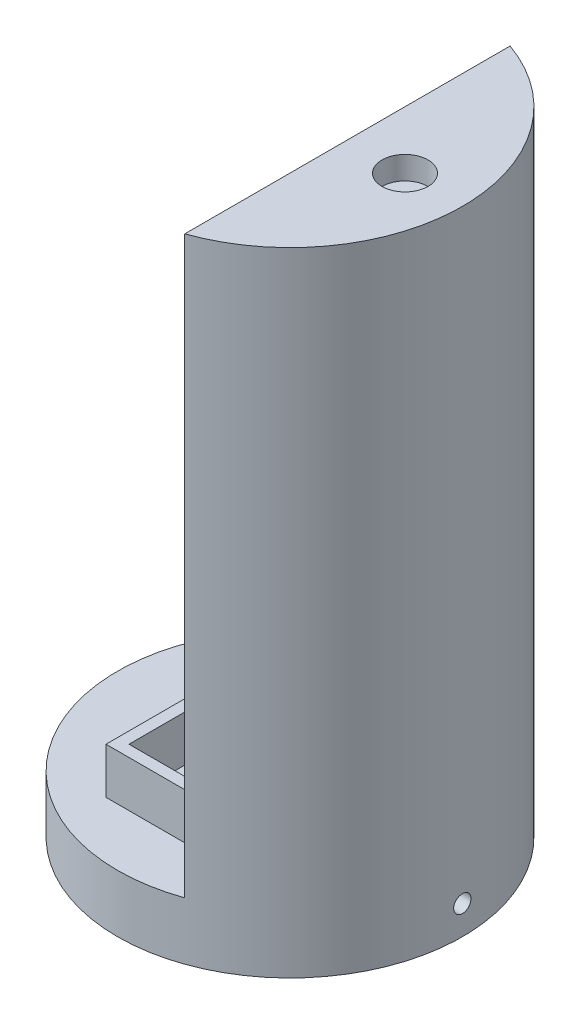
ISO-10303-21;
HEADER;
FILE_DESCRIPTION(('STEP AP214'),'2;1');
FILE_NAME('part.step','',(''),(''),'','','');
FILE_SCHEMA(('AUTOMOTIVE_DESIGN { 1 0 10303 214 1 1 1 1 }'));
ENDSEC;
DATA;
#1=APPLICATION_CONTEXT('core data for automotive mechanical design processes');
#2=APPLICATION_PROTOCOL_DEFINITION('international standard','automotive_design',2000,#1);
#3=PRODUCT_CONTEXT('',#1,'mechanical');
#4=PRODUCT('Part','Part','',(#3));
#5=PRODUCT_RELATED_PRODUCT_CATEGORY('part','',(#4));
#6=PRODUCT_DEFINITION_FORMATION('','',#4);
#7=PRODUCT_DEFINITION_CONTEXT('part definition',#1,'design');
#8=PRODUCT_DEFINITION('design','',#6,#7);
#9=PRODUCT_DEFINITION_SHAPE('','',#8);
#10=(LENGTH_UNIT() NAMED_UNIT(*) SI_UNIT(.MILLI.,.METRE.));
#11=(NAMED_UNIT(*) PLANE_ANGLE_UNIT() SI_UNIT($,.RADIAN.));
#12=(NAMED_UNIT(*) SI_UNIT($,.STERADIAN.) SOLID_ANGLE_UNIT());
#13=UNCERTAINTY_MEASURE_WITH_UNIT(LENGTH_MEASURE(1.E-05),#10,'distance_accuracy_value','');
#14=(GEOMETRIC_REPRESENTATION_CONTEXT(3) GLOBAL_UNCERTAINTY_ASSIGNED_CONTEXT((#13)) GLOBAL_UNIT_ASSIGNED_CONTEXT((#10,
#11,#12)) REPRESENTATION_CONTEXT('',''));
#15=CARTESIAN_POINT('',(0.,0.,0.));
#16=DIRECTION('',(0.,0.,1.));
#17=DIRECTION('',(1.,0.,0.));
#18=AXIS2_PLACEMENT_3D('',#15,#16,#17);
#19=CARTESIAN_POINT('',(0.,12.7,0.));
#20=DIRECTION('',(0.,-1.,0.));
#21=DIRECTION('',(0.,0.,-1.));
#22=AXIS2_PLACEMENT_3D('',#19,#20,#21);
#23=CYLINDRICAL_SURFACE('',#22,38.1);
#24=CARTESIAN_POINT('',(0.,12.7,0.));
#25=DIRECTION('',(0.,1.,0.));
#26=DIRECTION('',(0.,0.,1.));
#27=AXIS2_PLACEMENT_3D('',#24,#25,#26);
#28=CIRCLE('',#27,38.1);
#29=CARTESIAN_POINT('',(12.6806368116867,12.7,-35.9278645350666));
#30=VERTEX_POINT('',#29);
#31=CARTESIAN_POINT('',(12.6806368116867,12.7,35.9278645350666));
#32=VERTEX_POINT('',#31);
#33=EDGE_CURVE('E46',#30,#32,#28,.T.);
#34=ORIENTED_EDGE('',*,*,#33,.F.);
#35=DIRECTION('',(0.,-1.,0.));
#36=VECTOR('',#35,1.);
#37=CARTESIAN_POINT('',(12.6806368116867,139.7,-35.9278645350666));
#38=LINE('',#37,#36);
#39=CARTESIAN_POINT('',(12.6806368116867,139.7,-35.9278645350666));
#40=VERTEX_POINT('',#39);
#41=EDGE_CURVE('E125',#40,#30,#38,.T.);
#42=ORIENTED_EDGE('',*,*,#41,.F.);
#43=CARTESIAN_POINT('',(0.,139.7,0.));
#44=DIRECTION('',(0.,1.,0.));
#45=DIRECTION('',(0.,0.,1.));
#46=AXIS2_PLACEMENT_3D('',#43,#44,#45);
#47=CIRCLE('',#46,38.1);
#48=CARTESIAN_POINT('',(12.6806368116867,139.7,35.9278645350666));
#49=VERTEX_POINT('',#48);
#50=EDGE_CURVE('E118',#49,#40,#47,.T.);
#51=ORIENTED_EDGE('',*,*,#50,.F.);
#52=DIRECTION('',(0.,-1.,0.));
#53=VECTOR('',#52,1.);
#54=CARTESIAN_POINT('',(12.6806368116867,139.7,35.9278645350666));
#55=LINE('',#54,#53);
#56=EDGE_CURVE('E123',#49,#32,#55,.T.);
#57=ORIENTED_EDGE('',*,*,#56,.T.);
#58=EDGE_LOOP('',(#34,#42,#51,#57));
#59=FACE_BOUND('',#58,.T.);
#60=CARTESIAN_POINT('',(0.,0.,0.));
#61=DIRECTION('',(0.,1.,0.));
#62=DIRECTION('',(0.,0.,1.));
#63=AXIS2_PLACEMENT_3D('',#60,#61,#62);
#64=CIRCLE('',#63,38.1);
#65=CARTESIAN_POINT('',(0.,0.,38.1));
#66=VERTEX_POINT('',#65);
#67=EDGE_CURVE('E189',#66,#66,#64,.T.);
#68=ORIENTED_EDGE('',*,*,#67,.T.);
#69=EDGE_LOOP('',(#68));
#70=FACE_BOUND('',#69,.T.);
#71=CARTESIAN_POINT('',(-38.0523451971097,6.35,1.90499999999999));
#72=CARTESIAN_POINT('',(-38.0523458372646,6.45693290588869,1.90499528064471));
#73=CARTESIAN_POINT('',(-38.0528007885922,6.56394164568236,1.8959661010928));
#74=CARTESIAN_POINT('',(-38.0545717554989,6.77500712366543,1.86007496828752));
#75=CARTESIAN_POINT('',(-38.0558887856008,6.87906023284576,1.83319200356398));
#76=CARTESIAN_POINT('',(-38.0592343528177,7.08112641111174,1.76236492554556));
#77=CARTESIAN_POINT('',(-38.0612625271739,7.179142529787,1.71842950958168));
#78=CARTESIAN_POINT('',(-38.0658013905468,7.36638198231956,1.61475804513454));
#79=CARTESIAN_POINT('',(-38.0683119656292,7.45560738487128,1.55502572634059));
#80=CARTESIAN_POINT('',(-38.0735356425949,7.62284951446359,1.42138869135167));
#81=CARTESIAN_POINT('',(-38.0762489219195,7.7008562421088,1.34747146719899));
#82=CARTESIAN_POINT('',(-38.0815705997685,7.84336145141772,1.18758784411255));
#83=CARTESIAN_POINT('',(-38.0841789940082,7.90785938169321,1.10162095358684));
#84=CARTESIAN_POINT('',(-38.0889983266454,8.02154352551538,0.920026113944158));
#85=CARTESIAN_POINT('',(-38.0912090632333,8.07072197369968,0.824393297644863));
#86=CARTESIAN_POINT('',(-38.0949821658515,8.15232131191011,0.626215542712273));
#87=CARTESIAN_POINT('',(-38.0965445367887,8.18474232875511,0.523670656395599));
#88=CARTESIAN_POINT('',(-38.0988436608447,8.23188014044012,0.314671415599897));
#89=CARTESIAN_POINT('',(-38.0995811100001,8.24661186158189,0.208220435385266));
#90=CARTESIAN_POINT('',(-38.1001496214684,8.25799896585046,-0.00564587679819081));
#91=CARTESIAN_POINT('',(-38.0999806909141,8.25465449122724,-0.113061201171503));
#92=CARTESIAN_POINT('',(-38.0987560659568,8.22999652953438,-0.325706003577355));
#93=CARTESIAN_POINT('',(-38.0977011644333,8.20869910898177,-0.430937349856069));
#94=CARTESIAN_POINT('',(-38.0948243327178,8.14876471621186,-0.636329424385995));
#95=CARTESIAN_POINT('',(-38.0930023993098,8.11012767129669,-0.736490131376157));
#96=CARTESIAN_POINT('',(-38.0887953674449,8.01659247563749,-0.928949461337843));
#97=CARTESIAN_POINT('',(-38.0864100155674,7.96168700466695,-1.0212445209172));
#98=CARTESIAN_POINT('',(-38.0813447741745,7.83717886923093,-1.19531368846818));
#99=CARTESIAN_POINT('',(-38.0786648825792,7.76757610097564,-1.27708772213555));
#100=CARTESIAN_POINT('',(-38.0733088954562,7.61555830994845,-1.42788727708222));
#101=CARTESIAN_POINT('',(-38.0706328072934,7.53312934783952,-1.49689874745765));
#102=CARTESIAN_POINT('',(-38.0655890698724,7.35784799517476,-1.62010594974739));
#103=CARTESIAN_POINT('',(-38.0632214206961,7.26499560184932,-1.67430167772502));
#104=CARTESIAN_POINT('',(-38.0590617842516,7.07149464668819,-1.76633774924874));
#105=CARTESIAN_POINT('',(-38.0572698155799,6.97084583313193,-1.80417756445684));
#106=CARTESIAN_POINT('',(-38.0544643313005,6.76461291962913,-1.86241829155643));
#107=CARTESIAN_POINT('',(-38.0534508098381,6.65902885680732,-1.88281933460648));
#108=CARTESIAN_POINT('',(-38.0523175970383,6.44604498888611,-1.90558602819));
#109=CARTESIAN_POINT('',(-38.0521969391894,6.33864727334563,-1.90797118071586));
#110=CARTESIAN_POINT('',(-38.0528605368865,6.12497713893601,-1.89468928026819));
#111=CARTESIAN_POINT('',(-38.0536447894401,6.01870471634673,-1.87902228699278));
#112=CARTESIAN_POINT('',(-38.0560289329864,5.8103566346034,-1.83009699828166));
#113=CARTESIAN_POINT('',(-38.0576284100868,5.70827887419646,-1.79684762915573));
#114=CARTESIAN_POINT('',(-38.0614623752182,5.51115300279102,-1.71371045085396));
#115=CARTESIAN_POINT('',(-38.063696866924,5.41610493247657,-1.66382254539244));
#116=CARTESIAN_POINT('',(-38.0685513659328,5.23564678741141,-1.54877437789073));
#117=CARTESIAN_POINT('',(-38.0711717031923,5.15024507332023,-1.48360101590896));
#118=CARTESIAN_POINT('',(-38.0765013940179,4.99158798322229,-1.33985110683073));
#119=CARTESIAN_POINT('',(-38.0792107481531,4.91833268487622,-1.26127447404411));
#120=CARTESIAN_POINT('',(-38.0844159277627,4.78598234245765,-1.09286476425131));
#121=CARTESIAN_POINT('',(-38.0869115620207,4.72689989555022,-1.00302178063883));
#122=CARTESIAN_POINT('',(-38.0914053077819,4.62465850990913,-0.814679759205184));
#123=CARTESIAN_POINT('',(-38.0934034214507,4.58149950187105,-0.716180759060381));
#124=CARTESIAN_POINT('',(-38.096676024278,4.51235214583107,-0.513369591195939));
#125=CARTESIAN_POINT('',(-38.0979508530247,4.48635573890788,-0.40906017681841));
#126=CARTESIAN_POINT('',(-38.0996345639705,4.45224513580034,-0.197550588216465));
#127=CARTESIAN_POINT('',(-38.1000434510553,4.44413083872208,-0.0903504303055734));
#128=CARTESIAN_POINT('',(-38.0999492193628,4.44601575561356,0.123772590073404));
#129=CARTESIAN_POINT('',(-38.0994470954988,4.45599520942572,0.230695627491607));
#130=CARTESIAN_POINT('',(-38.0975893281055,4.49374350106739,0.441346231640851));
#131=CARTESIAN_POINT('',(-38.0962336829685,4.52151237240553,0.545073792352419));
#132=CARTESIAN_POINT('',(-38.0928213916629,4.59404720193706,0.746393139053858));
#133=CARTESIAN_POINT('',(-38.0907647403447,4.63881328499392,0.843984879963148));
#134=CARTESIAN_POINT('',(-38.0861817342955,4.74406835792604,1.03026851942982));
#135=CARTESIAN_POINT('',(-38.0836553939837,4.80455686515247,1.1189606910714));
#136=CARTESIAN_POINT('',(-38.0784142133899,4.93961045052615,1.28502623785078));
#137=CARTESIAN_POINT('',(-38.0756991903811,5.01418929779826,1.36238840889243));
#138=CARTESIAN_POINT('',(-38.0703878795251,5.17529759745909,1.50351876872455));
#139=CARTESIAN_POINT('',(-38.0677916210558,5.26182998564674,1.56728360818365));
#140=CARTESIAN_POINT('',(-38.063008920605,5.4444571185154,1.67943918705234));
#141=CARTESIAN_POINT('',(-38.0608228743648,5.54056096160387,1.72781511137466));
#142=CARTESIAN_POINT('',(-38.0571134110098,5.73946568245053,1.80768707555724));
#143=CARTESIAN_POINT('',(-38.0555892116128,5.842258487834,1.83920305362944));
#144=CARTESIAN_POINT('',(-38.053778892819,6.01307495844452,1.87619376168078));
#145=CARTESIAN_POINT('',(-38.0532436280332,6.07999220967407,1.88698230952192));
#146=CARTESIAN_POINT('',(-38.0525265776354,6.21459617054654,1.90138691991542));
#147=CARTESIAN_POINT('',(-38.0523447917205,6.28228287953009,1.90500298861371));
#148=CARTESIAN_POINT('',(-38.0523451971097,6.35,1.90499999999999));
#149=B_SPLINE_CURVE_WITH_KNOTS('',3,(#71,#72,#73,#74,#75,#76,#77,#78,#79,#80,#81,#82,#83,#84,
#85,#86,#87,#88,#89,#90,#91,#92,#93,#94,#95,#96,#97,#98,#99,#100,#101,#102,#103,#104,#105,#106,
#107,#108,#109,#110,#111,#112,#113,#114,#115,#116,#117,#118,#119,#120,#121,#122,#123,#124,#125,
#126,#127,#128,#129,#130,#131,#132,#133,#134,#135,#136,#137,#138,#139,#140,#141,#142,#143,#144,
#145,#146,#147,#148),.UNSPECIFIED.,.T.,.F.,(4,2,2,2,2,2,2,2,2,2,2,2,2,2,2,2,2,2,2,2,2,2,2,2,2,2,
2,2,2,2,2,2,2,2,2,2,2,2,4),(0.,0.320551524060626,0.641480963626901,0.96224693289059,
1.28293723599337,1.60391162746204,1.92489911758192,2.24604905074975,2.56719655344554,
2.8880728796769,3.20894668078709,3.52953362880772,3.8501219209292,4.17085468627854,
4.49158971666373,4.81267578403358,5.13376193671906,5.45485846053676,5.77595256933769,
6.0966990476117,6.417444465186,6.73802720121333,7.05861179245548,7.37947214158489,
7.70033454212425,8.0214810847243,8.34262622956469,8.66362046909027,8.98461289750674,
9.30525498171338,9.62589766989188,9.94654271359421,10.2671779152597,10.588128078616,
10.9091572081926,11.2304944674288,11.5514508753209,11.7544458710267,11.9574406927911),.UNSPECIFIED.);
#150=CARTESIAN_POINT('',(-38.0523451971097,6.35,1.90499999999999));
#151=VERTEX_POINT('',#150);
#152=EDGE_CURVE('E192',#151,#151,#149,.T.);
#153=ORIENTED_EDGE('',*,*,#152,.F.);
#154=EDGE_LOOP('',(#153));
#155=FACE_BOUND('',#154,.T.);
#156=CARTESIAN_POINT('',(38.0523451971097,6.35,1.90499999999999));
#157=CARTESIAN_POINT('',(38.0523458372646,6.24306709411131,1.90499528064471));
#158=CARTESIAN_POINT('',(38.0528007885922,6.13605835431764,1.8959661010928));
#159=CARTESIAN_POINT('',(38.0545717554989,5.92499287633457,1.86007496828752));
#160=CARTESIAN_POINT('',(38.0558887856008,5.82093976715424,1.83319200356398));
#161=CARTESIAN_POINT('',(38.0592343528177,5.61887358888826,1.76236492554556));
#162=CARTESIAN_POINT('',(38.0612625271739,5.520857470213,1.71842950958168));
#163=CARTESIAN_POINT('',(38.0658013905468,5.33361801768044,1.61475804513454));
#164=CARTESIAN_POINT('',(38.0683119656292,5.24439261512871,1.55502572634059));
#165=CARTESIAN_POINT('',(38.0735356425949,5.07715048553641,1.42138869135167));
#166=CARTESIAN_POINT('',(38.0762489219195,4.9991437578912,1.34747146719899));
#167=CARTESIAN_POINT('',(38.0815705997685,4.85663854858228,1.18758784411255));
#168=CARTESIAN_POINT('',(38.0841789940082,4.79214061830679,1.10162095358684));
#169=CARTESIAN_POINT('',(38.0889983266454,4.67845647448462,0.920026113944159));
#170=CARTESIAN_POINT('',(38.0912090632333,4.62927802630032,0.824393297644863));
#171=CARTESIAN_POINT('',(38.0949821658515,4.54767868808989,0.626215542712273));
#172=CARTESIAN_POINT('',(38.0965445367887,4.51525767124489,0.523670656395599));
#173=CARTESIAN_POINT('',(38.0988436608447,4.46811985955988,0.314671415599897));
#174=CARTESIAN_POINT('',(38.0995811100001,4.45338813841811,0.208220435385265));
#175=CARTESIAN_POINT('',(38.1001496214684,4.44200103414954,-0.00564587679819151));
#176=CARTESIAN_POINT('',(38.0999806909141,4.44534550877276,-0.113061201171503));
#177=CARTESIAN_POINT('',(38.0987560659568,4.47000347046562,-0.325706003577355));
#178=CARTESIAN_POINT('',(38.0977011644333,4.49130089101823,-0.430937349856069));
#179=CARTESIAN_POINT('',(38.0948243327178,4.55123528378814,-0.636329424385995));
#180=CARTESIAN_POINT('',(38.0930023993098,4.58987232870331,-0.736490131376157));
#181=CARTESIAN_POINT('',(38.0887953674449,4.68340752436251,-0.928949461337844));
#182=CARTESIAN_POINT('',(38.0864100155674,4.73831299533304,-1.0212445209172));
#183=CARTESIAN_POINT('',(38.0813447741745,4.86282113076907,-1.19531368846818));
#184=CARTESIAN_POINT('',(38.0786648825792,4.93242389902436,-1.27708772213556));
#185=CARTESIAN_POINT('',(38.0733088954562,5.08444169005155,-1.42788727708222));
#186=CARTESIAN_POINT('',(38.0706328072934,5.16687065216048,-1.49689874745765));
#187=CARTESIAN_POINT('',(38.0655890698724,5.34215200482524,-1.62010594974739));
#188=CARTESIAN_POINT('',(38.0632214206961,5.43500439815068,-1.67430167772502));
#189=CARTESIAN_POINT('',(38.0590617842516,5.62850535331181,-1.76633774924874));
#190=CARTESIAN_POINT('',(38.0572698155799,5.72915416686807,-1.80417756445684));
#191=CARTESIAN_POINT('',(38.0544643313005,5.93538708037087,-1.86241829155643));
#192=CARTESIAN_POINT('',(38.0534508098381,6.04097114319267,-1.88281933460648));
#193=CARTESIAN_POINT('',(38.0523175970383,6.25395501111389,-1.90558602819));
#194=CARTESIAN_POINT('',(38.0521969391894,6.36135272665437,-1.90797118071586));
#195=CARTESIAN_POINT('',(38.0528605368865,6.57502286106399,-1.89468928026819));
#196=CARTESIAN_POINT('',(38.0536447894401,6.68129528365327,-1.87902228699278));
#197=CARTESIAN_POINT('',(38.0560289329864,6.8896433653966,-1.83009699828166));
#198=CARTESIAN_POINT('',(38.0576284100868,6.99172112580354,-1.79684762915573));
#199=CARTESIAN_POINT('',(38.0614623752182,7.18884699720899,-1.71371045085396));
#200=CARTESIAN_POINT('',(38.063696866924,7.28389506752343,-1.66382254539244));
#201=CARTESIAN_POINT('',(38.0685513659328,7.46435321258859,-1.54877437789073));
#202=CARTESIAN_POINT('',(38.0711717031923,7.54975492667977,-1.48360101590896));
#203=CARTESIAN_POINT('',(38.0765013940179,7.70841201677771,-1.33985110683073));
#204=CARTESIAN_POINT('',(38.0792107481531,7.78166731512378,-1.26127447404411));
#205=CARTESIAN_POINT('',(38.0844159277627,7.91401765754235,-1.09286476425131));
#206=CARTESIAN_POINT('',(38.0869115620207,7.97310010444978,-1.00302178063882));
#207=CARTESIAN_POINT('',(38.0914053077819,8.07534149009087,-0.814679759205184));
#208=CARTESIAN_POINT('',(38.0934034214507,8.11850049812895,-0.716180759060381));
#209=CARTESIAN_POINT('',(38.096676024278,8.18764785416893,-0.513369591195939));
#210=CARTESIAN_POINT('',(38.0979508530247,8.21364426109212,-0.409060176818409));
#211=CARTESIAN_POINT('',(38.0996345639705,8.24775486419966,-0.197550588216464));
#212=CARTESIAN_POINT('',(38.1000434510553,8.25586916127792,-0.0903504303055732));
#213=CARTESIAN_POINT('',(38.0999492193628,8.25398424438644,0.123772590073404));
#214=CARTESIAN_POINT('',(38.0994470954988,8.24400479057428,0.230695627491607));
#215=CARTESIAN_POINT('',(38.0975893281055,8.20625649893261,0.441346231640851));
#216=CARTESIAN_POINT('',(38.0962336829685,8.17848762759447,0.545073792352419));
#217=CARTESIAN_POINT('',(38.0928213916629,8.10595279806294,0.746393139053858));
#218=CARTESIAN_POINT('',(38.0907647403447,8.06118671500608,0.843984879963148));
#219=CARTESIAN_POINT('',(38.0861817342955,7.95593164207396,1.03026851942982));
#220=CARTESIAN_POINT('',(38.0836553939837,7.89544313484753,1.1189606910714));
#221=CARTESIAN_POINT('',(38.0784142133899,7.76038954947385,1.28502623785078));
#222=CARTESIAN_POINT('',(38.0756991903811,7.68581070220174,1.36238840889243));
#223=CARTESIAN_POINT('',(38.0703878795251,7.52470240254091,1.50351876872455));
#224=CARTESIAN_POINT('',(38.0677916210558,7.43817001435326,1.56728360818365));
#225=CARTESIAN_POINT('',(38.063008920605,7.2555428814846,1.67943918705234));
#226=CARTESIAN_POINT('',(38.0608228743648,7.15943903839613,1.72781511137466));
#227=CARTESIAN_POINT('',(38.0571134110098,6.96053431754947,1.80768707555724));
#228=CARTESIAN_POINT('',(38.0555892116128,6.857741512166,1.83920305362944));
#229=CARTESIAN_POINT('',(38.053778892819,6.68692504155548,1.87619376168078));
#230=CARTESIAN_POINT('',(38.0532436280332,6.62000779032593,1.88698230952192));
#231=CARTESIAN_POINT('',(38.0525265776354,6.48540382945346,1.90138691991542));
#232=CARTESIAN_POINT('',(38.0523447917205,6.41771712046991,1.90500298861371));
#233=CARTESIAN_POINT('',(38.0523451971097,6.35,1.90499999999999));
#234=B_SPLINE_CURVE_WITH_KNOTS('',3,(#156,#157,#158,#159,#160,#161,#162,#163,#164,#165,#166,
#167,#168,#169,#170,#171,#172,#173,#174,#175,#176,#177,#178,#179,#180,#181,#182,#183,#184,#185,
#186,#187,#188,#189,#190,#191,#192,#193,#194,#195,#196,#197,#198,#199,#200,#201,#202,#203,#204,
#205,#206,#207,#208,#209,#210,#211,#212,#213,#214,#215,#216,#217,#218,#219,#220,#221,#222,#223,
#224,#225,#226,#227,#228,#229,#230,#231,#232,#233),.UNSPECIFIED.,.T.,.F.,(4,2,2,2,2,2,2,2,2,2,2,
2,2,2,2,2,2,2,2,2,2,2,2,2,2,2,2,2,2,2,2,2,2,2,2,2,2,2,4),(0.,0.320551524060626,
0.641480963626901,0.96224693289059,1.28293723599337,1.60391162746204,1.92489911758192,
2.24604905074975,2.56719655344554,2.8880728796769,3.20894668078709,3.52953362880772,
3.8501219209292,4.17085468627854,4.49158971666373,4.81267578403358,5.13376193671906,
5.45485846053676,5.77595256933769,6.0966990476117,6.417444465186,6.73802720121333,
7.05861179245548,7.37947214158489,7.70033454212426,8.02148108472431,8.34262622956469,
8.66362046909027,8.98461289750674,9.30525498171338,9.62589766989188,9.94654271359421,
10.2671779152597,10.588128078616,10.9091572081926,11.2304944674288,11.5514508753209,
11.7544458710267,11.9574406927911),.UNSPECIFIED.);
#235=CARTESIAN_POINT('',(38.0523451971097,6.35,1.90499999999999));
#236=VERTEX_POINT('',#235);
#237=EDGE_CURVE('E37',#236,#236,#234,.T.);
#238=ORIENTED_EDGE('',*,*,#237,.F.);
#239=EDGE_LOOP('',(#238));
#240=FACE_BOUND('',#239,.T.);
#241=ADVANCED_FACE('F33',(#59,#70,#155,#240),#23,.T.);
#242=CARTESIAN_POINT('',(0.,12.7,0.));
#243=DIRECTION('',(0.,1.,0.));
#244=DIRECTION('',(0.,0.,1.));
#245=AXIS2_PLACEMENT_3D('',#242,#243,#244);
#246=PLANE('',#245);
#247=ORIENTED_EDGE('',*,*,#33,.T.);
#248=DIRECTION('',(0.,0.,1.));
#249=VECTOR('',#248,1.);
#250=CARTESIAN_POINT('',(12.6806368116867,12.7,-25.4));
#251=LINE('',#250,#249);
#252=CARTESIAN_POINT('',(12.6806368116867,12.7,25.4));
#253=VERTEX_POINT('',#252);
#254=EDGE_CURVE('E134',#253,#32,#251,.T.);
#255=ORIENTED_EDGE('',*,*,#254,.F.);
#256=DIRECTION('',(1.,0.,0.));
#257=VECTOR('',#256,1.);
#258=CARTESIAN_POINT('',(-15.24,12.7,25.4));
#259=LINE('',#258,#257);
#260=CARTESIAN_POINT('',(-15.24,12.7,25.4));
#261=VERTEX_POINT('',#260);
#262=EDGE_CURVE('E180',#261,#253,#259,.T.);
#263=ORIENTED_EDGE('',*,*,#262,.F.);
#264=DIRECTION('',(0.,0.,1.));
#265=VECTOR('',#264,1.);
#266=CARTESIAN_POINT('',(-15.24,12.7,-25.4));
#267=LINE('',#266,#265);
#268=CARTESIAN_POINT('',(-15.24,12.7,-25.4));
#269=VERTEX_POINT('',#268);
#270=EDGE_CURVE('E167',#269,#261,#267,.T.);
#271=ORIENTED_EDGE('',*,*,#270,.F.);
#272=DIRECTION('',(-1.,0.,0.));
#273=VECTOR('',#272,1.);
#274=CARTESIAN_POINT('',(-15.24,12.7,-25.4));
#275=LINE('',#274,#273);
#276=CARTESIAN_POINT('',(12.6806368116867,12.7,-25.4));
#277=VERTEX_POINT('',#276);
#278=EDGE_CURVE('E172',#277,#269,#275,.T.);
#279=ORIENTED_EDGE('',*,*,#278,.F.);
#280=EDGE_CURVE('E130',#30,#277,#251,.T.);
#281=ORIENTED_EDGE('',*,*,#280,.F.);
#282=EDGE_LOOP('',(#247,#255,#263,#271,#279,#281));
#283=FACE_BOUND('',#282,.T.);
#284=ADVANCED_FACE('F277',(#283),#246,.T.);
#285=CARTESIAN_POINT('',(-15.24,22.86,25.4));
#286=DIRECTION('',(0.,0.,-1.));
#287=DIRECTION('',(-1.,0.,0.));
#288=AXIS2_PLACEMENT_3D('',#285,#286,#287);
#289=PLANE('',#288);
#290=DIRECTION('',(0.,-1.,0.));
#291=VECTOR('',#290,1.);
#292=CARTESIAN_POINT('',(12.6806368116867,22.86,25.4));
#293=LINE('',#292,#291);
#294=CARTESIAN_POINT('',(12.6806368116867,22.86,25.4));
#295=VERTEX_POINT('',#294);
#296=EDGE_CURVE('E144',#295,#253,#293,.T.);
#297=ORIENTED_EDGE('',*,*,#296,.F.);
#298=DIRECTION('',(1.,0.,0.));
#299=VECTOR('',#298,1.);
#300=CARTESIAN_POINT('',(-15.24,22.86,25.4));
#301=LINE('',#300,#299);
#302=CARTESIAN_POINT('',(-15.24,22.86,25.4));
#303=VERTEX_POINT('',#302);
#304=EDGE_CURVE('E171',#303,#295,#301,.T.);
#305=ORIENTED_EDGE('',*,*,#304,.F.);
#306=DIRECTION('',(0.,-1.,0.));
#307=VECTOR('',#306,1.);
#308=CARTESIAN_POINT('',(-15.24,22.86,25.4));
#309=LINE('',#308,#307);
#310=EDGE_CURVE('E186',#303,#261,#309,.T.);
#311=ORIENTED_EDGE('',*,*,#310,.T.);
#312=ORIENTED_EDGE('',*,*,#262,.T.);
#313=EDGE_LOOP('',(#297,#305,#311,#312));
#314=FACE_BOUND('',#313,.T.);
#315=ADVANCED_FACE('F273',(#314),#289,.F.);
#316=CARTESIAN_POINT('',(-15.24,22.86,-25.4));
#317=DIRECTION('',(0.,0.,1.));
#318=DIRECTION('',(1.,0.,0.));
#319=AXIS2_PLACEMENT_3D('',#316,#317,#318);
#320=PLANE('',#319);
#321=DIRECTION('',(0.,1.,0.));
#322=VECTOR('',#321,1.);
#323=CARTESIAN_POINT('',(12.6806368116867,22.86,-25.4));
#324=LINE('',#323,#322);
#325=CARTESIAN_POINT('',(12.6806368116867,22.86,-25.4));
#326=VERTEX_POINT('',#325);
#327=EDGE_CURVE('E148',#277,#326,#324,.T.);
#328=ORIENTED_EDGE('',*,*,#327,.F.);
#329=ORIENTED_EDGE('',*,*,#278,.T.);
#330=DIRECTION('',(0.,-1.,0.));
#331=VECTOR('',#330,1.);
#332=CARTESIAN_POINT('',(-15.24,22.86,-25.4));
#333=LINE('',#332,#331);
#334=CARTESIAN_POINT('',(-15.24,22.86,-25.4));
#335=VERTEX_POINT('',#334);
#336=EDGE_CURVE('E177',#335,#269,#333,.T.);
#337=ORIENTED_EDGE('',*,*,#336,.F.);
#338=DIRECTION('',(-1.,0.,0.));
#339=VECTOR('',#338,1.);
#340=CARTESIAN_POINT('',(-15.24,22.86,-25.4));
#341=LINE('',#340,#339);
#342=EDGE_CURVE('E175',#326,#335,#341,.T.);
#343=ORIENTED_EDGE('',*,*,#342,.F.);
#344=EDGE_LOOP('',(#328,#329,#337,#343));
#345=FACE_BOUND('',#344,.T.);
#346=ADVANCED_FACE('F269',(#345),#320,.F.);
#347=CARTESIAN_POINT('',(0.,22.86,0.));
#348=DIRECTION('',(0.,1.,0.));
#349=DIRECTION('',(0.,0.,1.));
#350=AXIS2_PLACEMENT_3D('',#347,#348,#349);
#351=PLANE('',#350);
#352=ORIENTED_EDGE('',*,*,#304,.T.);
#353=DIRECTION('',(0.,0.,-1.));
#354=VECTOR('',#353,1.);
#355=CARTESIAN_POINT('',(12.6806368116867,22.86,0.));
#356=LINE('',#355,#354);
#357=CARTESIAN_POINT('',(12.6806368116867,22.86,22.86));
#358=VERTEX_POINT('',#357);
#359=EDGE_CURVE('E137',#295,#358,#356,.T.);
#360=ORIENTED_EDGE('',*,*,#359,.T.);
#361=DIRECTION('',(1.,0.,0.));
#362=VECTOR('',#361,1.);
#363=CARTESIAN_POINT('',(-12.7,22.86,22.86));
#364=LINE('',#363,#362);
#365=CARTESIAN_POINT('',(-12.7,22.86,22.86));
#366=VERTEX_POINT('',#365);
#367=EDGE_CURVE('E158',#366,#358,#364,.T.);
#368=ORIENTED_EDGE('',*,*,#367,.F.);
#369=DIRECTION('',(0.,0.,1.));
#370=VECTOR('',#369,1.);
#371=CARTESIAN_POINT('',(-12.7,22.86,-22.86));
#372=LINE('',#371,#370);
#373=CARTESIAN_POINT('',(-12.7,22.86,-22.86));
#374=VERTEX_POINT('',#373);
#375=EDGE_CURVE('E61',#374,#366,#372,.T.);
#376=ORIENTED_EDGE('',*,*,#375,.F.);
#377=DIRECTION('',(-1.,0.,0.));
#378=VECTOR('',#377,1.);
#379=CARTESIAN_POINT('',(-12.7,22.86,-22.86));
#380=LINE('',#379,#378);
#381=CARTESIAN_POINT('',(12.6806368116867,22.86,-22.86));
#382=VERTEX_POINT('',#381);
#383=EDGE_CURVE('E161',#382,#374,#380,.T.);
#384=ORIENTED_EDGE('',*,*,#383,.F.);
#385=EDGE_CURVE('E145',#382,#326,#356,.T.);
#386=ORIENTED_EDGE('',*,*,#385,.T.);
#387=ORIENTED_EDGE('',*,*,#342,.T.);
#388=DIRECTION('',(0.,0.,1.));
#389=VECTOR('',#388,1.);
#390=CARTESIAN_POINT('',(-15.24,22.86,-25.4));
#391=LINE('',#390,#389);
#392=EDGE_CURVE('E168',#335,#303,#391,.T.);
#393=ORIENTED_EDGE('',*,*,#392,.T.);
#394=EDGE_LOOP('',(#352,#360,#368,#376,#384,#386,#387,#393));
#395=FACE_BOUND('',#394,.T.);
#396=ADVANCED_FACE('F259',(#395),#351,.T.);
#397=CARTESIAN_POINT('',(-12.7,-39.601801116214,-22.86));
#398=DIRECTION('',(0.,0.,-1.));
#399=DIRECTION('',(-1.,0.,0.));
#400=AXIS2_PLACEMENT_3D('',#397,#398,#399);
#401=PLANE('',#400);
#402=DIRECTION('',(0.,-1.,0.));
#403=VECTOR('',#402,1.);
#404=CARTESIAN_POINT('',(12.6806368116867,-39.601801116214,-22.86));
#405=LINE('',#404,#403);
#406=CARTESIAN_POINT('',(12.6806368116867,12.7,-22.86));
#407=VERTEX_POINT('',#406);
#408=EDGE_CURVE('E54',#382,#407,#405,.T.);
#409=ORIENTED_EDGE('',*,*,#408,.F.);
#410=ORIENTED_EDGE('',*,*,#383,.T.);
#411=DIRECTION('',(0.,1.,0.));
#412=VECTOR('',#411,1.);
#413=CARTESIAN_POINT('',(-12.7,-39.601801116214,-22.86));
#414=LINE('',#413,#412);
#415=CARTESIAN_POINT('',(-12.7,12.7,-22.86));
#416=VERTEX_POINT('',#415);
#417=EDGE_CURVE('E154',#416,#374,#414,.T.);
#418=ORIENTED_EDGE('',*,*,#417,.F.);
#419=DIRECTION('',(1.,0.,0.));
#420=VECTOR('',#419,1.);
#421=CARTESIAN_POINT('',(-12.7,12.7,-22.86));
#422=LINE('',#421,#420);
#423=EDGE_CURVE('E150',#416,#407,#422,.T.);
#424=ORIENTED_EDGE('',*,*,#423,.T.);
#425=EDGE_LOOP('',(#409,#410,#418,#424));
#426=FACE_BOUND('',#425,.T.);
#427=ADVANCED_FACE('F256',(#426),#401,.F.);
#428=CARTESIAN_POINT('',(-12.7,-39.601801116214,22.86));
#429=DIRECTION('',(0.,0.,1.));
#430=DIRECTION('',(1.,0.,0.));
#431=AXIS2_PLACEMENT_3D('',#428,#429,#430);
#432=PLANE('',#431);
#433=DIRECTION('',(0.,1.,0.));
#434=VECTOR('',#433,1.);
#435=CARTESIAN_POINT('',(12.6806368116867,-39.601801116214,22.86));
#436=LINE('',#435,#434);
#437=CARTESIAN_POINT('',(12.6806368116867,12.7,22.86));
#438=VERTEX_POINT('',#437);
#439=EDGE_CURVE('E135',#438,#358,#436,.T.);
#440=ORIENTED_EDGE('',*,*,#439,.F.);
#441=DIRECTION('',(-1.,0.,0.));
#442=VECTOR('',#441,1.);
#443=CARTESIAN_POINT('',(-12.7,12.7,22.86));
#444=LINE('',#443,#442);
#445=CARTESIAN_POINT('',(-12.7,12.7,22.86));
#446=VERTEX_POINT('',#445);
#447=EDGE_CURVE('E156',#438,#446,#444,.T.);
#448=ORIENTED_EDGE('',*,*,#447,.T.);
#449=DIRECTION('',(0.,1.,0.));
#450=VECTOR('',#449,1.);
#451=CARTESIAN_POINT('',(-12.7,-39.601801116214,22.86));
#452=LINE('',#451,#450);
#453=EDGE_CURVE('E163',#446,#366,#452,.T.);
#454=ORIENTED_EDGE('',*,*,#453,.T.);
#455=ORIENTED_EDGE('',*,*,#367,.T.);
#456=EDGE_LOOP('',(#440,#448,#454,#455));
#457=FACE_BOUND('',#456,.T.);
#458=ADVANCED_FACE('F254',(#457),#432,.F.);
#459=CARTESIAN_POINT('',(0.,12.7,0.));
#460=DIRECTION('',(0.,1.,0.));
#461=DIRECTION('',(0.,0.,1.));
#462=AXIS2_PLACEMENT_3D('',#459,#460,#461);
#463=PLANE('',#462);
#464=ORIENTED_EDGE('',*,*,#447,.F.);
#465=DIRECTION('',(0.,0.,-1.));
#466=VECTOR('',#465,1.);
#467=CARTESIAN_POINT('',(12.6806368116867,12.7,0.));
#468=LINE('',#467,#466);
#469=EDGE_CURVE('E11',#438,#407,#468,.T.);
#470=ORIENTED_EDGE('',*,*,#469,.T.);
#471=ORIENTED_EDGE('',*,*,#423,.F.);
#472=DIRECTION('',(0.,0.,-1.));
#473=VECTOR('',#472,1.);
#474=CARTESIAN_POINT('',(-12.7,12.7,-22.86));
#475=LINE('',#474,#473);
#476=EDGE_CURVE('E153',#446,#416,#475,.T.);
#477=ORIENTED_EDGE('',*,*,#476,.F.);
#478=EDGE_LOOP('',(#464,#470,#471,#477));
#479=FACE_BOUND('',#478,.T.);
#480=ADVANCED_FACE('F250',(#479),#463,.T.);
#481=CARTESIAN_POINT('',(0.,0.,0.));
#482=DIRECTION('',(0.,1.,0.));
#483=DIRECTION('',(0.,0.,1.));
#484=AXIS2_PLACEMENT_3D('',#481,#482,#483);
#485=PLANE('',#484);
#486=ORIENTED_EDGE('',*,*,#67,.F.);
#487=EDGE_LOOP('',(#486));
#488=FACE_BOUND('',#487,.T.);
#489=ADVANCED_FACE('F253',(#488),#485,.F.);
#490=CARTESIAN_POINT('',(-15.24,22.86,-25.4));
#491=DIRECTION('',(1.,0.,0.));
#492=DIRECTION('',(0.,0.,-1.));
#493=AXIS2_PLACEMENT_3D('',#490,#491,#492);
#494=PLANE('',#493);
#495=ORIENTED_EDGE('',*,*,#270,.T.);
#496=ORIENTED_EDGE('',*,*,#310,.F.);
#497=ORIENTED_EDGE('',*,*,#392,.F.);
#498=ORIENTED_EDGE('',*,*,#336,.T.);
#499=EDGE_LOOP('',(#495,#496,#497,#498));
#500=FACE_BOUND('',#499,.T.);
#501=ADVANCED_FACE('F266',(#500),#494,.F.);
#502=CARTESIAN_POINT('',(-12.7,-39.601801116214,-22.86));
#503=DIRECTION('',(-1.,0.,0.));
#504=DIRECTION('',(0.,0.,1.));
#505=AXIS2_PLACEMENT_3D('',#502,#503,#504);
#506=PLANE('',#505);
#507=ORIENTED_EDGE('',*,*,#476,.T.);
#508=ORIENTED_EDGE('',*,*,#417,.T.);
#509=ORIENTED_EDGE('',*,*,#375,.T.);
#510=ORIENTED_EDGE('',*,*,#453,.F.);
#511=EDGE_LOOP('',(#507,#508,#509,#510));
#512=FACE_BOUND('',#511,.T.);
#513=ADVANCED_FACE('F248',(#512),#506,.F.);
#514=CARTESIAN_POINT('',(12.6806368116867,139.7,-25.4));
#515=DIRECTION('',(1.,0.,0.));
#516=DIRECTION('',(0.,0.,-1.));
#517=AXIS2_PLACEMENT_3D('',#514,#515,#516);
#518=PLANE('',#517);
#519=CARTESIAN_POINT('',(12.6806368116867,129.781486407351,24.4673983653455));
#520=DIRECTION('',(-1.,0.,0.));
#521=DIRECTION('',(0.,0.,1.));
#522=AXIS2_PLACEMENT_3D('',#519,#520,#521);
#523=CIRCLE('',#522,1.27000000000001);
#524=CARTESIAN_POINT('',(12.6806368116867,129.781486407351,25.7373983653455));
#525=VERTEX_POINT('',#524);
#526=EDGE_CURVE('E464',#525,#525,#523,.T.);
#527=ORIENTED_EDGE('',*,*,#526,.F.);
#528=EDGE_LOOP('',(#527));
#529=FACE_BOUND('',#528,.T.);
#530=CARTESIAN_POINT('',(12.6806368116867,40.8770934776741,-25.8183570051908));
#531=DIRECTION('',(-1.,0.,0.));
#532=DIRECTION('',(0.,0.,1.));
#533=AXIS2_PLACEMENT_3D('',#530,#531,#532);
#534=CIRCLE('',#533,1.27);
#535=CARTESIAN_POINT('',(12.6806368116867,40.8770934776741,-24.5483570051908));
#536=VERTEX_POINT('',#535);
#537=EDGE_CURVE('E457',#536,#536,#534,.T.);
#538=ORIENTED_EDGE('',*,*,#537,.F.);
#539=EDGE_LOOP('',(#538));
#540=FACE_BOUND('',#539,.T.);
#541=CARTESIAN_POINT('',(12.6806368116867,40.8770934776741,24.4673983653455));
#542=DIRECTION('',(-1.,0.,0.));
#543=DIRECTION('',(0.,0.,1.));
#544=AXIS2_PLACEMENT_3D('',#541,#542,#543);
#545=CIRCLE('',#544,1.27);
#546=CARTESIAN_POINT('',(12.6806368116867,40.8770934776741,25.7373983653455));
#547=VERTEX_POINT('',#546);
#548=EDGE_CURVE('E451',#547,#547,#545,.T.);
#549=ORIENTED_EDGE('',*,*,#548,.F.);
#550=EDGE_LOOP('',(#549));
#551=FACE_BOUND('',#550,.T.);
#552=CARTESIAN_POINT('',(12.6806368116867,129.781486407351,-25.8183570051908));
#553=DIRECTION('',(-1.,0.,0.));
#554=DIRECTION('',(0.,0.,1.));
#555=AXIS2_PLACEMENT_3D('',#552,#553,#554);
#556=CIRCLE('',#555,1.27000000000001);
#557=CARTESIAN_POINT('',(12.6806368116867,129.781486407351,-24.5483570051908));
#558=VERTEX_POINT('',#557);
#559=EDGE_CURVE('E463',#558,#558,#556,.T.);
#560=ORIENTED_EDGE('',*,*,#559,.F.);
#561=EDGE_LOOP('',(#560));
#562=FACE_BOUND('',#561,.T.);
#563=ORIENTED_EDGE('',*,*,#280,.T.);
#564=ORIENTED_EDGE('',*,*,#327,.T.);
#565=ORIENTED_EDGE('',*,*,#385,.F.);
#566=ORIENTED_EDGE('',*,*,#408,.T.);
#567=ORIENTED_EDGE('',*,*,#469,.F.);
#568=ORIENTED_EDGE('',*,*,#439,.T.);
#569=ORIENTED_EDGE('',*,*,#359,.F.);
#570=ORIENTED_EDGE('',*,*,#296,.T.);
#571=ORIENTED_EDGE('',*,*,#254,.T.);
#572=ORIENTED_EDGE('',*,*,#56,.F.);
#573=DIRECTION('',(0.,0.,1.));
#574=VECTOR('',#573,1.);
#575=CARTESIAN_POINT('',(12.6806368116867,139.7,-25.4));
#576=LINE('',#575,#574);
#577=EDGE_CURVE('E127',#40,#49,#576,.T.);
#578=ORIENTED_EDGE('',*,*,#577,.F.);
#579=ORIENTED_EDGE('',*,*,#41,.T.);
#580=EDGE_LOOP('',(#563,#564,#565,#566,#567,#568,#569,#570,#571,#572,#578,#579));
#581=FACE_BOUND('',#580,.T.);
#582=ADVANCED_FACE('F132',(#529,#540,#551,#562,#581),#518,.F.);
#583=CARTESIAN_POINT('',(0.,139.7,0.));
#584=DIRECTION('',(0.,1.,0.));
#585=DIRECTION('',(0.,0.,1.));
#586=AXIS2_PLACEMENT_3D('',#583,#584,#585);
#587=PLANE('',#586);
#588=CARTESIAN_POINT('',(25.4,139.7,0.));
#589=DIRECTION('',(0.,1.,0.));
#590=DIRECTION('',(0.,0.,1.));
#591=AXIS2_PLACEMENT_3D('',#588,#589,#590);
#592=CIRCLE('',#591,5.08);
#593=CARTESIAN_POINT('',(25.4,139.7,5.08));
#594=VERTEX_POINT('',#593);
#595=EDGE_CURVE('E444',#594,#594,#592,.T.);
#596=ORIENTED_EDGE('',*,*,#595,.F.);
#597=EDGE_LOOP('',(#596));
#598=FACE_BOUND('',#597,.T.);
#599=ORIENTED_EDGE('',*,*,#577,.T.);
#600=ORIENTED_EDGE('',*,*,#50,.T.);
#601=EDGE_LOOP('',(#599,#600));
#602=FACE_BOUND('',#601,.T.);
#603=ADVANCED_FACE('F129',(#598,#602),#587,.T.);
#604=CARTESIAN_POINT('',(17.7606368116867,129.781486407351,-25.8183570051908));
#605=DIRECTION('',(-1.,0.,0.));
#606=DIRECTION('',(0.,0.,1.));
#607=AXIS2_PLACEMENT_3D('',#604,#605,#606);
#608=CYLINDRICAL_SURFACE('',#607,1.27000000000001);
#609=CARTESIAN_POINT('',(17.7606368116867,129.781486407351,-25.8183570051908));
#610=DIRECTION('',(-1.,0.,0.));
#611=DIRECTION('',(0.,0.,1.));
#612=AXIS2_PLACEMENT_3D('',#609,#610,#611);
#613=CIRCLE('',#612,1.27000000000001);
#614=CARTESIAN_POINT('',(17.7606368116867,129.781486407351,-24.5483570051908));
#615=VERTEX_POINT('',#614);
#616=EDGE_CURVE('E472',#615,#615,#613,.T.);
#617=ORIENTED_EDGE('',*,*,#616,.F.);
#618=EDGE_LOOP('',(#617));
#619=FACE_BOUND('',#618,.T.);
#620=ORIENTED_EDGE('',*,*,#559,.T.);
#621=EDGE_LOOP('',(#620));
#622=FACE_BOUND('',#621,.T.);
#623=ADVANCED_FACE('F238',(#619,#622),#608,.F.);
#624=CARTESIAN_POINT('',(17.7606368116867,129.781486407351,-25.8183570051908));
#625=DIRECTION('',(-1.,0.,0.));
#626=DIRECTION('',(0.,0.,1.));
#627=AXIS2_PLACEMENT_3D('',#624,#625,#626);
#628=PLANE('',#627);
#629=ORIENTED_EDGE('',*,*,#616,.T.);
#630=EDGE_LOOP('',(#629));
#631=FACE_BOUND('',#630,.T.);
#632=ADVANCED_FACE('F220',(#631),#628,.T.);
#633=CARTESIAN_POINT('',(17.7606368116867,40.8770934776741,24.4673983653455));
#634=DIRECTION('',(-1.,0.,0.));
#635=DIRECTION('',(0.,0.,1.));
#636=AXIS2_PLACEMENT_3D('',#633,#634,#635);
#637=CYLINDRICAL_SURFACE('',#636,1.27);
#638=CARTESIAN_POINT('',(17.7606368116867,40.8770934776741,24.4673983653455));
#639=DIRECTION('',(-1.,0.,0.));
#640=DIRECTION('',(0.,0.,1.));
#641=AXIS2_PLACEMENT_3D('',#638,#639,#640);
#642=CIRCLE('',#641,1.27);
#643=CARTESIAN_POINT('',(17.7606368116867,40.8770934776741,25.7373983653455));
#644=VERTEX_POINT('',#643);
#645=EDGE_CURVE('E454',#644,#644,#642,.T.);
#646=ORIENTED_EDGE('',*,*,#645,.F.);
#647=EDGE_LOOP('',(#646));
#648=FACE_BOUND('',#647,.T.);
#649=ORIENTED_EDGE('',*,*,#548,.T.);
#650=EDGE_LOOP('',(#649));
#651=FACE_BOUND('',#650,.T.);
#652=ADVANCED_FACE('F216',(#648,#651),#637,.F.);
#653=CARTESIAN_POINT('',(17.7606368116867,40.8770934776741,24.4673983653455));
#654=DIRECTION('',(-1.,0.,0.));
#655=DIRECTION('',(0.,0.,1.));
#656=AXIS2_PLACEMENT_3D('',#653,#654,#655);
#657=PLANE('',#656);
#658=ORIENTED_EDGE('',*,*,#645,.T.);
#659=EDGE_LOOP('',(#658));
#660=FACE_BOUND('',#659,.T.);
#661=ADVANCED_FACE('F212',(#660),#657,.T.);
#662=CARTESIAN_POINT('',(17.7606368116867,40.8770934776741,-25.8183570051908));
#663=DIRECTION('',(-1.,0.,0.));
#664=DIRECTION('',(0.,0.,1.));
#665=AXIS2_PLACEMENT_3D('',#662,#663,#664);
#666=CYLINDRICAL_SURFACE('',#665,1.27);
#667=CARTESIAN_POINT('',(17.7606368116867,40.8770934776741,-25.8183570051908));
#668=DIRECTION('',(-1.,0.,0.));
#669=DIRECTION('',(0.,0.,1.));
#670=AXIS2_PLACEMENT_3D('',#667,#668,#669);
#671=CIRCLE('',#670,1.27);
#672=CARTESIAN_POINT('',(17.7606368116867,40.8770934776741,-24.5483570051908));
#673=VERTEX_POINT('',#672);
#674=EDGE_CURVE('E467',#673,#673,#671,.T.);
#675=ORIENTED_EDGE('',*,*,#674,.F.);
#676=EDGE_LOOP('',(#675));
#677=FACE_BOUND('',#676,.T.);
#678=ORIENTED_EDGE('',*,*,#537,.T.);
#679=EDGE_LOOP('',(#678));
#680=FACE_BOUND('',#679,.T.);
#681=ADVANCED_FACE('F215',(#677,#680),#666,.F.);
#682=CARTESIAN_POINT('',(17.7606368116867,40.8770934776741,-25.8183570051908));
#683=DIRECTION('',(-1.,0.,0.));
#684=DIRECTION('',(0.,0.,1.));
#685=AXIS2_PLACEMENT_3D('',#682,#683,#684);
#686=PLANE('',#685);
#687=ORIENTED_EDGE('',*,*,#674,.T.);
#688=EDGE_LOOP('',(#687));
#689=FACE_BOUND('',#688,.T.);
#690=ADVANCED_FACE('F228',(#689),#686,.T.);
#691=CARTESIAN_POINT('',(17.7606368116867,129.781486407351,24.4673983653455));
#692=DIRECTION('',(-1.,0.,0.));
#693=DIRECTION('',(0.,0.,1.));
#694=AXIS2_PLACEMENT_3D('',#691,#692,#693);
#695=CYLINDRICAL_SURFACE('',#694,1.27000000000001);
#696=CARTESIAN_POINT('',(17.7606368116867,129.781486407351,24.4673983653455));
#697=DIRECTION('',(-1.,0.,0.));
#698=DIRECTION('',(0.,0.,1.));
#699=AXIS2_PLACEMENT_3D('',#696,#697,#698);
#700=CIRCLE('',#699,1.27000000000001);
#701=CARTESIAN_POINT('',(17.7606368116867,129.781486407351,25.7373983653455));
#702=VERTEX_POINT('',#701);
#703=EDGE_CURVE('E460',#702,#702,#700,.T.);
#704=ORIENTED_EDGE('',*,*,#703,.F.);
#705=EDGE_LOOP('',(#704));
#706=FACE_BOUND('',#705,.T.);
#707=ORIENTED_EDGE('',*,*,#526,.T.);
#708=EDGE_LOOP('',(#707));
#709=FACE_BOUND('',#708,.T.);
#710=ADVANCED_FACE('F224',(#706,#709),#695,.F.);
#711=CARTESIAN_POINT('',(17.7606368116867,129.781486407351,24.4673983653455));
#712=DIRECTION('',(-1.,0.,0.));
#713=DIRECTION('',(0.,0.,1.));
#714=AXIS2_PLACEMENT_3D('',#711,#712,#713);
#715=PLANE('',#714);
#716=ORIENTED_EDGE('',*,*,#703,.T.);
#717=EDGE_LOOP('',(#716));
#718=FACE_BOUND('',#717,.T.);
#719=ADVANCED_FACE('F210',(#718),#715,.T.);
#720=CARTESIAN_POINT('',(25.4,134.62,0.));
#721=DIRECTION('',(0.,1.,0.));
#722=DIRECTION('',(0.,0.,1.));
#723=AXIS2_PLACEMENT_3D('',#720,#721,#722);
#724=CYLINDRICAL_SURFACE('',#723,5.08);
#725=CARTESIAN_POINT('',(25.4,134.62,0.));
#726=DIRECTION('',(0.,1.,0.));
#727=DIRECTION('',(0.,0.,1.));
#728=AXIS2_PLACEMENT_3D('',#725,#726,#727);
#729=CIRCLE('',#728,5.08);
#730=CARTESIAN_POINT('',(25.4,134.62,5.08));
#731=VERTEX_POINT('',#730);
#732=EDGE_CURVE('E446',#731,#731,#729,.T.);
#733=ORIENTED_EDGE('',*,*,#732,.F.);
#734=EDGE_LOOP('',(#733));
#735=FACE_BOUND('',#734,.T.);
#736=ORIENTED_EDGE('',*,*,#595,.T.);
#737=EDGE_LOOP('',(#736));
#738=FACE_BOUND('',#737,.T.);
#739=ADVANCED_FACE('F206',(#735,#738),#724,.F.);
#740=CARTESIAN_POINT('',(25.4,134.62,0.));
#741=DIRECTION('',(0.,1.,0.));
#742=DIRECTION('',(0.,0.,1.));
#743=AXIS2_PLACEMENT_3D('',#740,#741,#742);
#744=PLANE('',#743);
#745=ORIENTED_EDGE('',*,*,#732,.T.);
#746=EDGE_LOOP('',(#745));
#747=FACE_BOUND('',#746,.T.);
#748=ADVANCED_FACE('F201',(#747),#744,.T.);
#749=CARTESIAN_POINT('',(57.658,6.35,0.));
#750=DIRECTION('',(-1.,0.,0.));
#751=DIRECTION('',(0.,0.,1.));
#752=AXIS2_PLACEMENT_3D('',#749,#750,#751);
#753=CYLINDRICAL_SURFACE('',#752,1.905);
#754=ORIENTED_EDGE('',*,*,#152,.T.);
#755=EDGE_LOOP('',(#754));
#756=FACE_BOUND('',#755,.T.);
#757=ORIENTED_EDGE('',*,*,#237,.T.);
#758=EDGE_LOOP('',(#757));
#759=FACE_BOUND('',#758,.T.);
#760=ADVANCED_FACE('F197',(#756,#759),#753,.F.);
#761=CLOSED_SHELL('',(#241,#284,#315,#346,#396,#427,#458,#480,#489,#501,#513,#582,#603,#623,
#632,#652,#661,#681,#690,#710,#719,#739,#748,#760));
#762=MANIFOLD_SOLID_BREP('B2',#761);
#763=ADVANCED_BREP_SHAPE_REPRESENTATION('',(#18,#762),#14);
#764=SHAPE_DEFINITION_REPRESENTATION(#9,#763);
ENDSEC;
END-ISO-10303-21;
